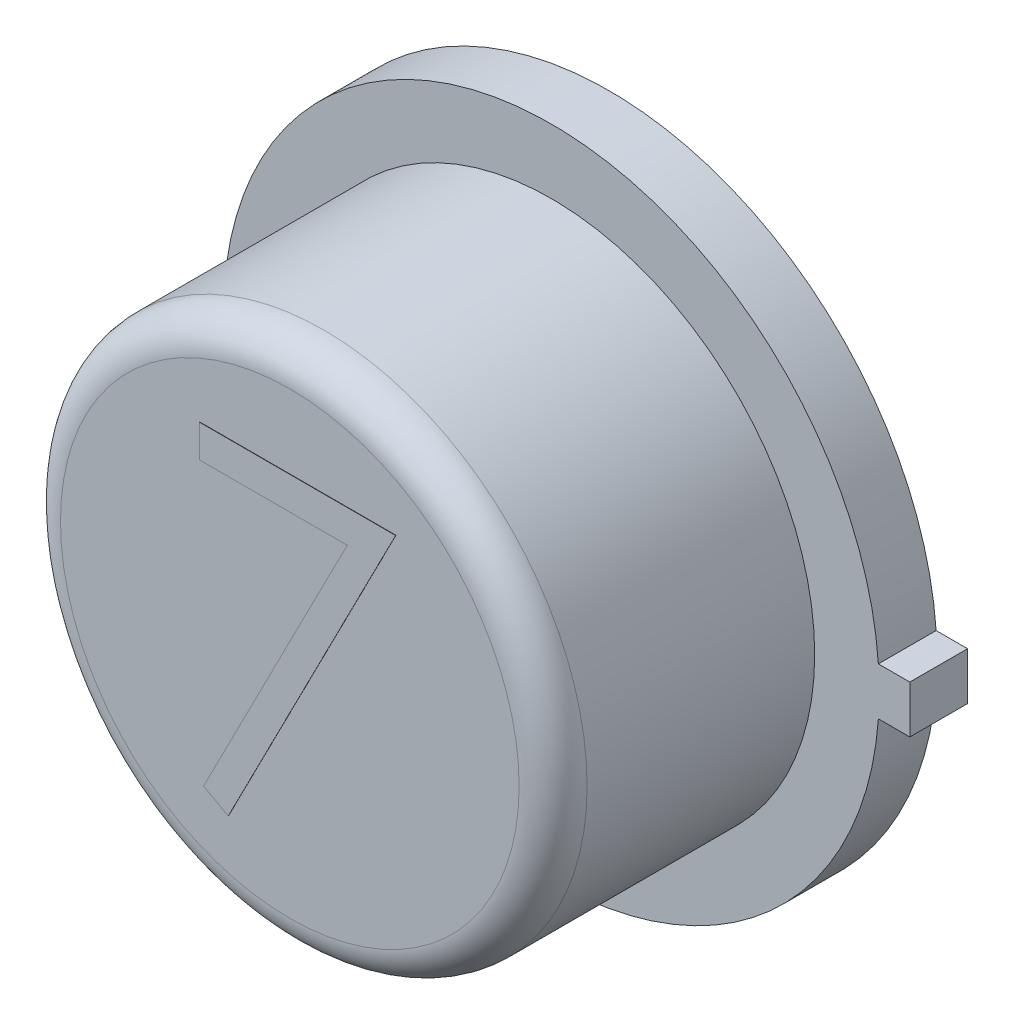
ISO-10303-21;
HEADER;
FILE_DESCRIPTION(('STEP AP214'),'2;1');
FILE_NAME('part.step','',(''),(''),'','','');
FILE_SCHEMA(('AUTOMOTIVE_DESIGN { 1 0 10303 214 1 1 1 1 }'));
ENDSEC;
DATA;
#1=APPLICATION_CONTEXT('core data for automotive mechanical design processes');
#2=APPLICATION_PROTOCOL_DEFINITION('international standard','automotive_design',2000,#1);
#3=PRODUCT_CONTEXT('',#1,'mechanical');
#4=PRODUCT('Part','Part','',(#3));
#5=PRODUCT_RELATED_PRODUCT_CATEGORY('part','',(#4));
#6=PRODUCT_DEFINITION_FORMATION('','',#4);
#7=PRODUCT_DEFINITION_CONTEXT('part definition',#1,'design');
#8=PRODUCT_DEFINITION('design','',#6,#7);
#9=PRODUCT_DEFINITION_SHAPE('','',#8);
#10=(LENGTH_UNIT() NAMED_UNIT(*) SI_UNIT(.MILLI.,.METRE.));
#11=(NAMED_UNIT(*) PLANE_ANGLE_UNIT() SI_UNIT($,.RADIAN.));
#12=(NAMED_UNIT(*) SI_UNIT($,.STERADIAN.) SOLID_ANGLE_UNIT());
#13=UNCERTAINTY_MEASURE_WITH_UNIT(LENGTH_MEASURE(1.E-05),#10,'distance_accuracy_value','');
#14=(GEOMETRIC_REPRESENTATION_CONTEXT(3) GLOBAL_UNCERTAINTY_ASSIGNED_CONTEXT((#13)) GLOBAL_UNIT_ASSIGNED_CONTEXT((#10,
#11,#12)) REPRESENTATION_CONTEXT('',''));
#15=CARTESIAN_POINT('',(0.,0.,0.));
#16=DIRECTION('',(0.,0.,1.));
#17=DIRECTION('',(1.,0.,0.));
#18=AXIS2_PLACEMENT_3D('',#15,#16,#17);
#19=CARTESIAN_POINT('',(-0.00322860507148085,-5.53029106093277,0.));
#20=DIRECTION('',(0.,0.,1.));
#21=DIRECTION('',(1.,0.,0.));
#22=AXIS2_PLACEMENT_3D('',#19,#20,#21);
#23=PLANE('',#22);
#24=DIRECTION('',(1.,0.,0.));
#25=VECTOR('',#24,1.);
#26=CARTESIAN_POINT('',(-0.0032286050714822,0.177799999999999,0.));
#27=LINE('',#26,#25);
#28=CARTESIAN_POINT('',(2.44464278985704,0.177799999999999,0.));
#29=VERTEX_POINT('',#28);
#30=CARTESIAN_POINT('',(2.6797,0.177799999999999,0.));
#31=VERTEX_POINT('',#30);
#32=EDGE_CURVE('E170',#29,#31,#27,.T.);
#33=ORIENTED_EDGE('',*,*,#32,.T.);
#34=DIRECTION('',(0.,-1.,0.));
#35=VECTOR('',#34,1.);
#36=CARTESIAN_POINT('',(2.6797,-5.53029106093277,0.));
#37=LINE('',#36,#35);
#38=CARTESIAN_POINT('',(2.6797,-0.1778,0.));
#39=VERTEX_POINT('',#38);
#40=EDGE_CURVE('E175',#31,#39,#37,.T.);
#41=ORIENTED_EDGE('',*,*,#40,.T.);
#42=DIRECTION('',(-1.,0.,0.));
#43=VECTOR('',#42,1.);
#44=CARTESIAN_POINT('',(-0.00322860507148085,-0.1778,0.));
#45=LINE('',#44,#43);
#46=CARTESIAN_POINT('',(2.44464278985704,-0.1778,0.));
#47=VERTEX_POINT('',#46);
#48=EDGE_CURVE('E189',#39,#47,#45,.T.);
#49=ORIENTED_EDGE('',*,*,#48,.T.);
#50=CARTESIAN_POINT('',(0.,0.,0.));
#51=DIRECTION('',(0.,0.,1.));
#52=DIRECTION('',(1.,0.,0.));
#53=AXIS2_PLACEMENT_3D('',#50,#51,#52);
#54=CIRCLE('',#53,2.4511);
#55=EDGE_CURVE('E186',#29,#47,#54,.T.);
#56=ORIENTED_EDGE('',*,*,#55,.F.);
#57=EDGE_LOOP('',(#33,#41,#49,#56));
#58=FACE_BOUND('',#57,.T.);
#59=CARTESIAN_POINT('',(0.,0.,0.));
#60=DIRECTION('',(0.,0.,1.));
#61=DIRECTION('',(1.,0.,0.));
#62=AXIS2_PLACEMENT_3D('',#59,#60,#61);
#63=CIRCLE('',#62,1.75756648099992);
#64=CARTESIAN_POINT('',(1.75756648099992,0.,0.));
#65=VERTEX_POINT('',#64);
#66=EDGE_CURVE('E201',#65,#65,#63,.F.);
#67=ORIENTED_EDGE('',*,*,#66,.F.);
#68=EDGE_LOOP('',(#67));
#69=FACE_BOUND('',#68,.T.);
#70=ADVANCED_FACE('F33',(#58,#69),#23,.F.);
#71=CARTESIAN_POINT('',(-0.00322860507148085,-5.53029106093277,0.4318));
#72=DIRECTION('',(0.,0.,1.));
#73=DIRECTION('',(1.,0.,0.));
#74=AXIS2_PLACEMENT_3D('',#71,#72,#73);
#75=PLANE('',#74);
#76=DIRECTION('',(1.,0.,0.));
#77=VECTOR('',#76,1.);
#78=CARTESIAN_POINT('',(-0.0032286050714822,0.177799999999999,0.4318));
#79=LINE('',#78,#77);
#80=CARTESIAN_POINT('',(2.44464278985704,0.177799999999999,0.4318));
#81=VERTEX_POINT('',#80);
#82=CARTESIAN_POINT('',(2.6797,0.177799999999999,0.4318));
#83=VERTEX_POINT('',#82);
#84=EDGE_CURVE('E171',#81,#83,#79,.T.);
#85=ORIENTED_EDGE('',*,*,#84,.F.);
#86=CARTESIAN_POINT('',(0.,0.,0.4318));
#87=DIRECTION('',(0.,0.,1.));
#88=DIRECTION('',(1.,0.,0.));
#89=AXIS2_PLACEMENT_3D('',#86,#87,#88);
#90=CIRCLE('',#89,2.4511);
#91=CARTESIAN_POINT('',(2.44464278985704,-0.1778,0.4318));
#92=VERTEX_POINT('',#91);
#93=EDGE_CURVE('E174',#81,#92,#90,.T.);
#94=ORIENTED_EDGE('',*,*,#93,.T.);
#95=DIRECTION('',(-1.,0.,0.));
#96=VECTOR('',#95,1.);
#97=CARTESIAN_POINT('',(-0.00322860507148085,-0.1778,0.4318));
#98=LINE('',#97,#96);
#99=CARTESIAN_POINT('',(2.6797,-0.1778,0.4318));
#100=VERTEX_POINT('',#99);
#101=EDGE_CURVE('E177',#100,#92,#98,.T.);
#102=ORIENTED_EDGE('',*,*,#101,.F.);
#103=DIRECTION('',(0.,-1.,0.));
#104=VECTOR('',#103,1.);
#105=CARTESIAN_POINT('',(2.6797,-5.53029106093277,0.4318));
#106=LINE('',#105,#104);
#107=EDGE_CURVE('E180',#83,#100,#106,.T.);
#108=ORIENTED_EDGE('',*,*,#107,.F.);
#109=EDGE_LOOP('',(#85,#94,#102,#108));
#110=FACE_BOUND('',#109,.T.);
#111=CARTESIAN_POINT('',(0.,0.,0.4318));
#112=DIRECTION('',(0.,0.,1.));
#113=DIRECTION('',(1.,0.,0.));
#114=AXIS2_PLACEMENT_3D('',#111,#112,#113);
#115=CIRCLE('',#114,1.9685);
#116=CARTESIAN_POINT('',(1.9685,0.,0.4318));
#117=VERTEX_POINT('',#116);
#118=EDGE_CURVE('E167',#117,#117,#115,.T.);
#119=ORIENTED_EDGE('',*,*,#118,.F.);
#120=EDGE_LOOP('',(#119));
#121=FACE_BOUND('',#120,.T.);
#122=ADVANCED_FACE('F222',(#110,#121),#75,.T.);
#123=CARTESIAN_POINT('',(-0.0032286050714822,0.177799999999999,0.4318));
#124=DIRECTION('',(0.,1.,0.));
#125=DIRECTION('',(-1.,0.,0.));
#126=AXIS2_PLACEMENT_3D('',#123,#124,#125);
#127=PLANE('',#126);
#128=ORIENTED_EDGE('',*,*,#32,.F.);
#129=DIRECTION('',(0.,0.,-1.));
#130=VECTOR('',#129,1.);
#131=CARTESIAN_POINT('',(2.44464278985704,0.177799999999999,0.4318));
#132=LINE('',#131,#130);
#133=EDGE_CURVE('E199',#81,#29,#132,.T.);
#134=ORIENTED_EDGE('',*,*,#133,.F.);
#135=ORIENTED_EDGE('',*,*,#84,.T.);
#136=DIRECTION('',(0.,0.,-1.));
#137=VECTOR('',#136,1.);
#138=CARTESIAN_POINT('',(2.6797,0.177799999999999,0.4318));
#139=LINE('',#138,#137);
#140=EDGE_CURVE('E183',#83,#31,#139,.T.);
#141=ORIENTED_EDGE('',*,*,#140,.T.);
#142=EDGE_LOOP('',(#128,#134,#135,#141));
#143=FACE_BOUND('',#142,.T.);
#144=ADVANCED_FACE('F228',(#143),#127,.T.);
#145=CARTESIAN_POINT('',(0.,0.,0.4318));
#146=DIRECTION('',(0.,0.,-1.));
#147=DIRECTION('',(-1.,0.,0.));
#148=AXIS2_PLACEMENT_3D('',#145,#146,#147);
#149=CYLINDRICAL_SURFACE('',#148,2.4511);
#150=ORIENTED_EDGE('',*,*,#55,.T.);
#151=DIRECTION('',(0.,0.,-1.));
#152=VECTOR('',#151,1.);
#153=CARTESIAN_POINT('',(2.44464278985704,-0.1778,0.4318));
#154=LINE('',#153,#152);
#155=EDGE_CURVE('E197',#92,#47,#154,.T.);
#156=ORIENTED_EDGE('',*,*,#155,.F.);
#157=ORIENTED_EDGE('',*,*,#93,.F.);
#158=ORIENTED_EDGE('',*,*,#133,.T.);
#159=EDGE_LOOP('',(#150,#156,#157,#158));
#160=FACE_BOUND('',#159,.T.);
#161=ADVANCED_FACE('F242',(#160),#149,.T.);
#162=CARTESIAN_POINT('',(-0.00322860507148085,-0.1778,0.4318));
#163=DIRECTION('',(0.,-1.,0.));
#164=DIRECTION('',(0.,0.,-1.));
#165=AXIS2_PLACEMENT_3D('',#162,#163,#164);
#166=PLANE('',#165);
#167=ORIENTED_EDGE('',*,*,#48,.F.);
#168=DIRECTION('',(0.,0.,-1.));
#169=VECTOR('',#168,1.);
#170=CARTESIAN_POINT('',(2.6797,-0.1778,0.4318));
#171=LINE('',#170,#169);
#172=EDGE_CURVE('E195',#100,#39,#171,.T.);
#173=ORIENTED_EDGE('',*,*,#172,.F.);
#174=ORIENTED_EDGE('',*,*,#101,.T.);
#175=ORIENTED_EDGE('',*,*,#155,.T.);
#176=EDGE_LOOP('',(#167,#173,#174,#175));
#177=FACE_BOUND('',#176,.T.);
#178=ADVANCED_FACE('F238',(#177),#166,.T.);
#179=CARTESIAN_POINT('',(2.6797,-5.53029106093277,0.4318));
#180=DIRECTION('',(1.,0.,0.));
#181=DIRECTION('',(0.,0.,-1.));
#182=AXIS2_PLACEMENT_3D('',#179,#180,#181);
#183=PLANE('',#182);
#184=ORIENTED_EDGE('',*,*,#40,.F.);
#185=ORIENTED_EDGE('',*,*,#140,.F.);
#186=ORIENTED_EDGE('',*,*,#107,.T.);
#187=ORIENTED_EDGE('',*,*,#172,.T.);
#188=EDGE_LOOP('',(#184,#185,#186,#187));
#189=FACE_BOUND('',#188,.T.);
#190=ADVANCED_FACE('F234',(#189),#183,.T.);
#191=CARTESIAN_POINT('',(0.,0.,2.3876));
#192=DIRECTION('',(0.,0.,-1.));
#193=DIRECTION('',(-1.,0.,0.));
#194=AXIS2_PLACEMENT_3D('',#191,#192,#193);
#195=CYLINDRICAL_SURFACE('',#194,1.9685);
#196=CARTESIAN_POINT('',(0.,0.,2.1336));
#197=DIRECTION('',(0.,0.,1.));
#198=DIRECTION('',(1.,0.,0.));
#199=AXIS2_PLACEMENT_3D('',#196,#197,#198);
#200=CIRCLE('',#199,1.9685);
#201=CARTESIAN_POINT('',(1.9685,0.,2.1336));
#202=VERTEX_POINT('',#201);
#203=EDGE_CURVE('E11',#202,#202,#200,.F.);
#204=ORIENTED_EDGE('',*,*,#203,.T.);
#205=EDGE_LOOP('',(#204));
#206=FACE_BOUND('',#205,.T.);
#207=ORIENTED_EDGE('',*,*,#118,.T.);
#208=EDGE_LOOP('',(#207));
#209=FACE_BOUND('',#208,.T.);
#210=ADVANCED_FACE('F237',(#206,#209),#195,.T.);
#211=CARTESIAN_POINT('',(0.,0.,2.3876));
#212=DIRECTION('',(0.,0.,1.));
#213=DIRECTION('',(1.,0.,0.));
#214=AXIS2_PLACEMENT_3D('',#211,#212,#213);
#215=PLANE('',#214);
#216=DIRECTION('',(0.,1.,0.));
#217=VECTOR('',#216,1.);
#218=CARTESIAN_POINT('',(-0.671634615384615,0.9188780238478,2.3876));
#219=LINE('',#218,#217);
#220=CARTESIAN_POINT('',(-0.671634615384615,0.9188780238478,2.3876));
#221=VERTEX_POINT('',#220);
#222=CARTESIAN_POINT('',(-0.671634615384615,1.16310879307857,2.3876));
#223=VERTEX_POINT('',#222);
#224=EDGE_CURVE('E146',#221,#223,#219,.T.);
#225=ORIENTED_EDGE('',*,*,#224,.T.);
#226=DIRECTION('',(1.,0.,0.));
#227=VECTOR('',#226,1.);
#228=CARTESIAN_POINT('',(-0.671634615384615,1.16310879307857,2.3876));
#229=LINE('',#228,#227);
#230=CARTESIAN_POINT('',(0.79375,1.16310879307857,2.3876));
#231=VERTEX_POINT('',#230);
#232=EDGE_CURVE('E115',#223,#231,#229,.T.);
#233=ORIENTED_EDGE('',*,*,#232,.T.);
#234=DIRECTION('',(-0.456090790910399,-0.889933250556876,0.));
#235=VECTOR('',#234,1.);
#236=CARTESIAN_POINT('',(0.79375,1.16310879307857,2.3876));
#237=LINE('',#236,#235);
#238=CARTESIAN_POINT('',(-0.457932692307692,-1.27919889922912,2.3876));
#239=VERTEX_POINT('',#238);
#240=EDGE_CURVE('E149',#231,#239,#237,.T.);
#241=ORIENTED_EDGE('',*,*,#240,.T.);
#242=DIRECTION('',(-0.876072484374681,0.482179429384514,0.));
#243=VECTOR('',#242,1.);
#244=CARTESIAN_POINT('',(-0.457932692307692,-1.27919889922912,2.3876));
#245=LINE('',#244,#243);
#246=CARTESIAN_POINT('',(-0.642536808894231,-1.17759508312335,2.3876));
#247=VERTEX_POINT('',#246);
#248=EDGE_CURVE('E151',#239,#247,#245,.T.);
#249=ORIENTED_EDGE('',*,*,#248,.T.);
#250=DIRECTION('',(0.456180989989924,0.889887017756644,0.));
#251=VECTOR('',#250,1.);
#252=CARTESIAN_POINT('',(-0.642536808894231,-1.17759508312335,2.3876));
#253=LINE('',#252,#251);
#254=CARTESIAN_POINT('',(0.432173978365384,0.9188780238478,2.3876));
#255=VERTEX_POINT('',#254);
#256=EDGE_CURVE('E53',#247,#255,#253,.T.);
#257=ORIENTED_EDGE('',*,*,#256,.T.);
#258=DIRECTION('',(-1.,0.,0.));
#259=VECTOR('',#258,1.);
#260=CARTESIAN_POINT('',(0.432173978365385,0.9188780238478,2.3876));
#261=LINE('',#260,#259);
#262=EDGE_CURVE('E48',#255,#221,#261,.T.);
#263=ORIENTED_EDGE('',*,*,#262,.T.);
#264=EDGE_LOOP('',(#225,#233,#241,#249,#257,#263));
#265=FACE_BOUND('',#264,.T.);
#266=CARTESIAN_POINT('',(0.,0.,2.3876));
#267=DIRECTION('',(0.,0.,1.));
#268=DIRECTION('',(1.,0.,0.));
#269=AXIS2_PLACEMENT_3D('',#266,#267,#268);
#270=CIRCLE('',#269,1.7145);
#271=CARTESIAN_POINT('',(1.7145,0.,2.3876));
#272=VERTEX_POINT('',#271);
#273=EDGE_CURVE('E41',#272,#272,#270,.T.);
#274=ORIENTED_EDGE('',*,*,#273,.T.);
#275=EDGE_LOOP('',(#274));
#276=FACE_BOUND('',#275,.T.);
#277=ADVANCED_FACE('F206',(#265,#276),#215,.T.);
#278=CARTESIAN_POINT('',(0.,0.,-0.00254));
#279=DIRECTION('',(0.,0.,1.));
#280=DIRECTION('',(1.,0.,0.));
#281=AXIS2_PLACEMENT_3D('',#278,#279,#280);
#282=CYLINDRICAL_SURFACE('',#281,1.75756648099992);
#283=CARTESIAN_POINT('',(0.,0.,-0.00254));
#284=DIRECTION('',(0.,0.,-1.));
#285=DIRECTION('',(-1.,0.,0.));
#286=AXIS2_PLACEMENT_3D('',#283,#284,#285);
#287=CIRCLE('',#286,1.75756648099992);
#288=CARTESIAN_POINT('',(-1.75756648099992,0.,-0.00254));
#289=VERTEX_POINT('',#288);
#290=EDGE_CURVE('E155',#289,#289,#287,.T.);
#291=ORIENTED_EDGE('',*,*,#290,.F.);
#292=EDGE_LOOP('',(#291));
#293=FACE_BOUND('',#292,.T.);
#294=ORIENTED_EDGE('',*,*,#66,.T.);
#295=EDGE_LOOP('',(#294));
#296=FACE_BOUND('',#295,.T.);
#297=ADVANCED_FACE('F217',(#293,#296),#282,.T.);
#298=CARTESIAN_POINT('',(0.,0.,-0.00254));
#299=DIRECTION('',(0.,0.,-1.));
#300=DIRECTION('',(-1.,0.,0.));
#301=AXIS2_PLACEMENT_3D('',#298,#299,#300);
#302=PLANE('',#301);
#303=ORIENTED_EDGE('',*,*,#290,.T.);
#304=EDGE_LOOP('',(#303));
#305=FACE_BOUND('',#304,.T.);
#306=ADVANCED_FACE('F209',(#305),#302,.T.);
#307=CARTESIAN_POINT('',(0.,0.,2.1336));
#308=DIRECTION('',(0.,0.,1.));
#309=DIRECTION('',(1.,0.,0.));
#310=AXIS2_PLACEMENT_3D('',#307,#308,#309);
#311=TOROIDAL_SURFACE('',#310,1.7145,0.254);
#312=ORIENTED_EDGE('',*,*,#203,.F.);
#313=EDGE_LOOP('',(#312));
#314=FACE_BOUND('',#313,.T.);
#315=ORIENTED_EDGE('',*,*,#273,.F.);
#316=EDGE_LOOP('',(#315));
#317=FACE_BOUND('',#316,.T.);
#318=ADVANCED_FACE('F35',(#314,#317),#311,.T.);
#319=CARTESIAN_POINT('',(-0.671634615384615,0.9188780238478,2.39014));
#320=DIRECTION('',(-1.,0.,0.));
#321=DIRECTION('',(0.,0.,1.));
#322=AXIS2_PLACEMENT_3D('',#319,#320,#321);
#323=PLANE('',#322);
#324=ORIENTED_EDGE('',*,*,#224,.F.);
#325=DIRECTION('',(0.,0.,-1.));
#326=VECTOR('',#325,1.);
#327=CARTESIAN_POINT('',(-0.671634615384615,0.9188780238478,2.39014));
#328=LINE('',#327,#326);
#329=CARTESIAN_POINT('',(-0.671634615384615,0.9188780238478,2.39014));
#330=VERTEX_POINT('',#329);
#331=EDGE_CURVE('E134',#330,#221,#328,.T.);
#332=ORIENTED_EDGE('',*,*,#331,.F.);
#333=DIRECTION('',(0.,1.,0.));
#334=VECTOR('',#333,1.);
#335=CARTESIAN_POINT('',(-0.671634615384615,0.9188780238478,2.39014));
#336=LINE('',#335,#334);
#337=CARTESIAN_POINT('',(-0.671634615384615,1.16310879307857,2.39014));
#338=VERTEX_POINT('',#337);
#339=EDGE_CURVE('E127',#330,#338,#336,.T.);
#340=ORIENTED_EDGE('',*,*,#339,.T.);
#341=DIRECTION('',(0.,0.,-1.));
#342=VECTOR('',#341,1.);
#343=CARTESIAN_POINT('',(-0.671634615384615,1.16310879307857,2.39014));
#344=LINE('',#343,#342);
#345=EDGE_CURVE('E110',#338,#223,#344,.T.);
#346=ORIENTED_EDGE('',*,*,#345,.T.);
#347=EDGE_LOOP('',(#324,#332,#340,#346));
#348=FACE_BOUND('',#347,.T.);
#349=ADVANCED_FACE('F133',(#348),#323,.T.);
#350=CARTESIAN_POINT('',(0.432173978365385,0.9188780238478,2.39014));
#351=DIRECTION('',(0.,-1.,0.));
#352=DIRECTION('',(0.,0.,-1.));
#353=AXIS2_PLACEMENT_3D('',#350,#351,#352);
#354=PLANE('',#353);
#355=ORIENTED_EDGE('',*,*,#262,.F.);
#356=DIRECTION('',(0.,0.,-1.));
#357=VECTOR('',#356,1.);
#358=CARTESIAN_POINT('',(0.432173978365385,0.9188780238478,2.39014));
#359=LINE('',#358,#357);
#360=CARTESIAN_POINT('',(0.432173978365385,0.9188780238478,2.39014));
#361=VERTEX_POINT('',#360);
#362=EDGE_CURVE('E156',#361,#255,#359,.T.);
#363=ORIENTED_EDGE('',*,*,#362,.F.);
#364=DIRECTION('',(-1.,0.,0.));
#365=VECTOR('',#364,1.);
#366=CARTESIAN_POINT('',(0.432173978365385,0.9188780238478,2.39014));
#367=LINE('',#366,#365);
#368=EDGE_CURVE('E120',#361,#330,#367,.T.);
#369=ORIENTED_EDGE('',*,*,#368,.T.);
#370=ORIENTED_EDGE('',*,*,#331,.T.);
#371=EDGE_LOOP('',(#355,#363,#369,#370));
#372=FACE_BOUND('',#371,.T.);
#373=ADVANCED_FACE('F215',(#372),#354,.T.);
#374=CARTESIAN_POINT('',(-0.642536808894231,-1.17759508312335,2.39014));
#375=DIRECTION('',(-0.889887017756644,0.456180989989924,0.));
#376=DIRECTION('',(-0.456180989989924,-0.889887017756644,0.));
#377=AXIS2_PLACEMENT_3D('',#374,#375,#376);
#378=PLANE('',#377);
#379=ORIENTED_EDGE('',*,*,#256,.F.);
#380=DIRECTION('',(0.,0.,-1.));
#381=VECTOR('',#380,1.);
#382=CARTESIAN_POINT('',(-0.642536808894231,-1.17759508312335,2.39014));
#383=LINE('',#382,#381);
#384=CARTESIAN_POINT('',(-0.642536808894231,-1.17759508312335,2.39014));
#385=VERTEX_POINT('',#384);
#386=EDGE_CURVE('E158',#385,#247,#383,.T.);
#387=ORIENTED_EDGE('',*,*,#386,.F.);
#388=DIRECTION('',(0.456180989989924,0.889887017756644,0.));
#389=VECTOR('',#388,1.);
#390=CARTESIAN_POINT('',(-0.642536808894231,-1.17759508312335,2.39014));
#391=LINE('',#390,#389);
#392=EDGE_CURVE('E142',#385,#361,#391,.T.);
#393=ORIENTED_EDGE('',*,*,#392,.T.);
#394=ORIENTED_EDGE('',*,*,#362,.T.);
#395=EDGE_LOOP('',(#379,#387,#393,#394));
#396=FACE_BOUND('',#395,.T.);
#397=ADVANCED_FACE('F281',(#396),#378,.T.);
#398=CARTESIAN_POINT('',(-0.457932692307692,-1.27919889922912,2.39014));
#399=DIRECTION('',(-0.482179429384514,-0.876072484374681,0.));
#400=DIRECTION('',(0.876072484374681,-0.482179429384514,0.));
#401=AXIS2_PLACEMENT_3D('',#398,#399,#400);
#402=PLANE('',#401);
#403=ORIENTED_EDGE('',*,*,#248,.F.);
#404=DIRECTION('',(0.,0.,-1.));
#405=VECTOR('',#404,1.);
#406=CARTESIAN_POINT('',(-0.457932692307692,-1.27919889922912,2.39014));
#407=LINE('',#406,#405);
#408=CARTESIAN_POINT('',(-0.457932692307692,-1.27919889922912,2.39014));
#409=VERTEX_POINT('',#408);
#410=EDGE_CURVE('E161',#409,#239,#407,.T.);
#411=ORIENTED_EDGE('',*,*,#410,.F.);
#412=DIRECTION('',(-0.876072484374681,0.482179429384514,0.));
#413=VECTOR('',#412,1.);
#414=CARTESIAN_POINT('',(-0.457932692307692,-1.27919889922912,2.39014));
#415=LINE('',#414,#413);
#416=EDGE_CURVE('E139',#409,#385,#415,.T.);
#417=ORIENTED_EDGE('',*,*,#416,.T.);
#418=ORIENTED_EDGE('',*,*,#386,.T.);
#419=EDGE_LOOP('',(#403,#411,#417,#418));
#420=FACE_BOUND('',#419,.T.);
#421=ADVANCED_FACE('F277',(#420),#402,.T.);
#422=CARTESIAN_POINT('',(0.79375,1.16310879307857,2.39014));
#423=DIRECTION('',(0.889933250556876,-0.456090790910399,0.));
#424=DIRECTION('',(0.456090790910399,0.889933250556876,0.));
#425=AXIS2_PLACEMENT_3D('',#422,#423,#424);
#426=PLANE('',#425);
#427=ORIENTED_EDGE('',*,*,#240,.F.);
#428=DIRECTION('',(0.,0.,-1.));
#429=VECTOR('',#428,1.);
#430=CARTESIAN_POINT('',(0.79375,1.16310879307857,2.39014));
#431=LINE('',#430,#429);
#432=CARTESIAN_POINT('',(0.79375,1.16310879307857,2.39014));
#433=VERTEX_POINT('',#432);
#434=EDGE_CURVE('E119',#433,#231,#431,.T.);
#435=ORIENTED_EDGE('',*,*,#434,.F.);
#436=DIRECTION('',(-0.456090790910399,-0.889933250556876,0.));
#437=VECTOR('',#436,1.);
#438=CARTESIAN_POINT('',(0.79375,1.16310879307857,2.39014));
#439=LINE('',#438,#437);
#440=EDGE_CURVE('E131',#433,#409,#439,.T.);
#441=ORIENTED_EDGE('',*,*,#440,.T.);
#442=ORIENTED_EDGE('',*,*,#410,.T.);
#443=EDGE_LOOP('',(#427,#435,#441,#442));
#444=FACE_BOUND('',#443,.T.);
#445=ADVANCED_FACE('F274',(#444),#426,.T.);
#446=CARTESIAN_POINT('',(-0.671634615384615,1.16310879307857,2.39014));
#447=DIRECTION('',(0.,1.,0.));
#448=DIRECTION('',(0.,0.,1.));
#449=AXIS2_PLACEMENT_3D('',#446,#447,#448);
#450=PLANE('',#449);
#451=ORIENTED_EDGE('',*,*,#232,.F.);
#452=ORIENTED_EDGE('',*,*,#345,.F.);
#453=DIRECTION('',(1.,0.,0.));
#454=VECTOR('',#453,1.);
#455=CARTESIAN_POINT('',(-0.671634615384615,1.16310879307857,2.39014));
#456=LINE('',#455,#454);
#457=EDGE_CURVE('E114',#338,#433,#456,.T.);
#458=ORIENTED_EDGE('',*,*,#457,.T.);
#459=ORIENTED_EDGE('',*,*,#434,.T.);
#460=EDGE_LOOP('',(#451,#452,#458,#459));
#461=FACE_BOUND('',#460,.T.);
#462=ADVANCED_FACE('F112',(#461),#450,.T.);
#463=CARTESIAN_POINT('',(-0.671634615384615,1.16310879307857,2.39014));
#464=DIRECTION('',(0.,0.,-1.));
#465=DIRECTION('',(-1.,0.,0.));
#466=AXIS2_PLACEMENT_3D('',#463,#464,#465);
#467=PLANE('',#466);
#468=ORIENTED_EDGE('',*,*,#339,.F.);
#469=ORIENTED_EDGE('',*,*,#368,.F.);
#470=ORIENTED_EDGE('',*,*,#392,.F.);
#471=ORIENTED_EDGE('',*,*,#416,.F.);
#472=ORIENTED_EDGE('',*,*,#440,.F.);
#473=ORIENTED_EDGE('',*,*,#457,.F.);
#474=EDGE_LOOP('',(#468,#469,#470,#471,#472,#473));
#475=FACE_BOUND('',#474,.T.);
#476=ADVANCED_FACE('F125',(#475),#467,.F.);
#477=CLOSED_SHELL('',(#70,#122,#144,#161,#178,#190,#210,#277,#297,#306,#318,#349,#373,#397,#421,
#445,#462,#476));
#478=MANIFOLD_SOLID_BREP('B2',#477);
#479=ADVANCED_BREP_SHAPE_REPRESENTATION('',(#18,#478),#14);
#480=SHAPE_DEFINITION_REPRESENTATION(#9,#479);
ENDSEC;
END-ISO-10303-21;
